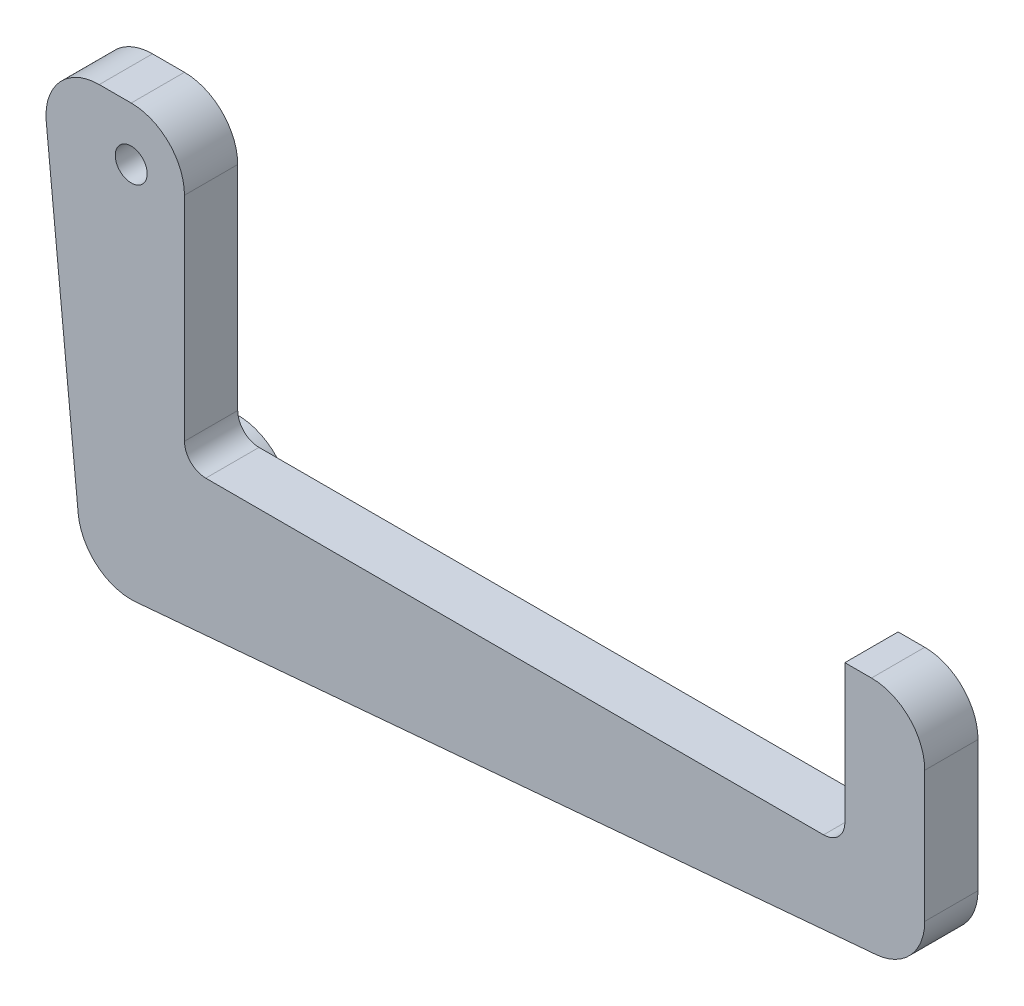
ISO-10303-21;
HEADER;
FILE_DESCRIPTION(('STEP AP214'),'2;1');
FILE_NAME('part.step','',(''),(''),'','','');
FILE_SCHEMA(('AUTOMOTIVE_DESIGN { 1 0 10303 214 1 1 1 1 }'));
ENDSEC;
DATA;
#1=APPLICATION_CONTEXT('core data for automotive mechanical design processes');
#2=APPLICATION_PROTOCOL_DEFINITION('international standard','automotive_design',2000,#1);
#3=PRODUCT_CONTEXT('',#1,'mechanical');
#4=PRODUCT('Part','Part','',(#3));
#5=PRODUCT_RELATED_PRODUCT_CATEGORY('part','',(#4));
#6=PRODUCT_DEFINITION_FORMATION('','',#4);
#7=PRODUCT_DEFINITION_CONTEXT('part definition',#1,'design');
#8=PRODUCT_DEFINITION('design','',#6,#7);
#9=PRODUCT_DEFINITION_SHAPE('','',#8);
#10=(LENGTH_UNIT() NAMED_UNIT(*) SI_UNIT(.MILLI.,.METRE.));
#11=(NAMED_UNIT(*) PLANE_ANGLE_UNIT() SI_UNIT($,.RADIAN.));
#12=(NAMED_UNIT(*) SI_UNIT($,.STERADIAN.) SOLID_ANGLE_UNIT());
#13=UNCERTAINTY_MEASURE_WITH_UNIT(LENGTH_MEASURE(1.E-05),#10,'distance_accuracy_value','');
#14=(GEOMETRIC_REPRESENTATION_CONTEXT(3) GLOBAL_UNCERTAINTY_ASSIGNED_CONTEXT((#13)) GLOBAL_UNIT_ASSIGNED_CONTEXT((#10,
#11,#12)) REPRESENTATION_CONTEXT('',''));
#15=CARTESIAN_POINT('',(0.,0.,0.));
#16=DIRECTION('',(0.,0.,1.));
#17=DIRECTION('',(1.,0.,0.));
#18=AXIS2_PLACEMENT_3D('',#15,#16,#17);
#19=CARTESIAN_POINT('',(19.05,-10.16,6.35));
#20=DIRECTION('',(0.,0.,-1.));
#21=DIRECTION('',(-1.,0.,0.));
#22=AXIS2_PLACEMENT_3D('',#19,#20,#21);
#23=CYLINDRICAL_SURFACE('',#22,6.35);
#24=DIRECTION('',(0.,0.,1.));
#25=VECTOR('',#24,1.);
#26=CARTESIAN_POINT('',(19.05,-3.80999999999999,0.));
#27=LINE('',#26,#25);
#28=CARTESIAN_POINT('',(19.05,-3.80999999999999,0.));
#29=VERTEX_POINT('',#28);
#30=CARTESIAN_POINT('',(19.05,-3.80999999999999,6.35));
#31=VERTEX_POINT('',#30);
#32=EDGE_CURVE('E263',#29,#31,#27,.T.);
#33=ORIENTED_EDGE('',*,*,#32,.T.);
#34=CARTESIAN_POINT('',(19.05,-10.16,6.35));
#35=DIRECTION('',(0.,0.,1.));
#36=DIRECTION('',(1.,0.,0.));
#37=AXIS2_PLACEMENT_3D('',#34,#35,#36);
#38=CIRCLE('',#37,6.35);
#39=CARTESIAN_POINT('',(25.4,-10.16,6.35));
#40=VERTEX_POINT('',#39);
#41=EDGE_CURVE('E225',#40,#31,#38,.T.);
#42=ORIENTED_EDGE('',*,*,#41,.F.);
#43=DIRECTION('',(0.,0.,-1.));
#44=VECTOR('',#43,1.);
#45=CARTESIAN_POINT('',(25.4,-10.16,6.35));
#46=LINE('',#45,#44);
#47=CARTESIAN_POINT('',(25.4,-10.16,0.));
#48=VERTEX_POINT('',#47);
#49=EDGE_CURVE('E193',#40,#48,#46,.T.);
#50=ORIENTED_EDGE('',*,*,#49,.T.);
#51=CARTESIAN_POINT('',(19.05,-10.16,0.));
#52=DIRECTION('',(0.,0.,1.));
#53=DIRECTION('',(-1.,0.,0.));
#54=AXIS2_PLACEMENT_3D('',#51,#52,#53);
#55=CIRCLE('',#54,6.35);
#56=EDGE_CURVE('E172',#48,#29,#55,.T.);
#57=ORIENTED_EDGE('',*,*,#56,.T.);
#58=EDGE_LOOP('',(#33,#42,#50,#57));
#59=FACE_BOUND('',#58,.T.);
#60=ADVANCED_FACE('F32',(#59),#23,.T.);
#61=CARTESIAN_POINT('',(101.6,-35.56,6.35));
#62=DIRECTION('',(0.,0.,-1.));
#63=DIRECTION('',(-1.,0.,0.));
#64=AXIS2_PLACEMENT_3D('',#61,#62,#63);
#65=PLANE('',#64);
#66=ORIENTED_EDGE('',*,*,#41,.T.);
#67=DIRECTION('',(-1.,0.,0.));
#68=VECTOR('',#67,1.);
#69=CARTESIAN_POINT('',(15.24,-3.80999999999999,6.35));
#70=LINE('',#69,#68);
#71=CARTESIAN_POINT('',(15.24,-3.80999999999999,6.35));
#72=VERTEX_POINT('',#71);
#73=EDGE_CURVE('E278',#31,#72,#70,.T.);
#74=ORIENTED_EDGE('',*,*,#73,.T.);
#75=CARTESIAN_POINT('',(15.24,-10.16,6.35));
#76=DIRECTION('',(0.,0.,1.));
#77=DIRECTION('',(-1.,0.,0.));
#78=AXIS2_PLACEMENT_3D('',#75,#76,#77);
#79=CIRCLE('',#78,6.35);
#80=CARTESIAN_POINT('',(8.92075359058098,-10.7841993407915,6.35));
#81=VERTEX_POINT('',#80);
#82=EDGE_CURVE('E276',#72,#81,#79,.T.);
#83=ORIENTED_EDGE('',*,*,#82,.T.);
#84=DIRECTION('',(0.0982991087860656,-0.99515691486914,0.));
#85=VECTOR('',#84,1.);
#86=CARTESIAN_POINT('',(12.730753590581,-49.3557377044119,6.35));
#87=LINE('',#86,#85);
#88=CARTESIAN_POINT('',(12.730753590581,-49.3557377044119,6.35));
#89=VERTEX_POINT('',#88);
#90=EDGE_CURVE('E47',#81,#89,#87,.T.);
#91=ORIENTED_EDGE('',*,*,#90,.T.);
#92=CARTESIAN_POINT('',(19.05,-48.7315383636204,6.35));
#93=DIRECTION('',(0.,0.,1.));
#94=DIRECTION('',(1.,0.,0.));
#95=AXIS2_PLACEMENT_3D('',#92,#93,#94);
#96=CIRCLE('',#95,6.34999999999999);
#97=CARTESIAN_POINT('',(19.6034389664476,-55.057374696503,6.35));
#98=VERTEX_POINT('',#97);
#99=EDGE_CURVE('E228',#89,#98,#96,.T.);
#100=ORIENTED_EDGE('',*,*,#99,.T.);
#101=DIRECTION('',(0.996194698091746,0.0871557427476517,0.));
#102=VECTOR('',#101,1.);
#103=CARTESIAN_POINT('',(19.6034389664476,-55.057374696503,6.35));
#104=LINE('',#103,#102);
#105=CARTESIAN_POINT('',(107.868438966448,-47.3351878103879,6.35));
#106=VERTEX_POINT('',#105);
#107=EDGE_CURVE('E234',#98,#106,#104,.T.);
#108=ORIENTED_EDGE('',*,*,#107,.T.);
#109=CARTESIAN_POINT('',(107.315,-41.0093514775053,6.35));
#110=DIRECTION('',(0.,0.,1.));
#111=DIRECTION('',(1.,0.,0.));
#112=AXIS2_PLACEMENT_3D('',#109,#110,#111);
#113=CIRCLE('',#112,6.35);
#114=CARTESIAN_POINT('',(113.665,-41.0093514775053,6.35));
#115=VERTEX_POINT('',#114);
#116=EDGE_CURVE('E138',#106,#115,#113,.T.);
#117=ORIENTED_EDGE('',*,*,#116,.T.);
#118=DIRECTION('',(0.,1.,0.));
#119=VECTOR('',#118,1.);
#120=CARTESIAN_POINT('',(113.665,-41.0093514775053,6.35));
#121=LINE('',#120,#119);
#122=CARTESIAN_POINT('',(113.665,-25.4,6.35));
#123=VERTEX_POINT('',#122);
#124=EDGE_CURVE('E129',#115,#123,#121,.T.);
#125=ORIENTED_EDGE('',*,*,#124,.T.);
#126=CARTESIAN_POINT('',(107.315,-25.4,6.35));
#127=DIRECTION('',(0.,0.,1.));
#128=DIRECTION('',(1.,0.,0.));
#129=AXIS2_PLACEMENT_3D('',#126,#127,#128);
#130=CIRCLE('',#129,6.35);
#131=CARTESIAN_POINT('',(107.315,-19.05,6.35));
#132=VERTEX_POINT('',#131);
#133=EDGE_CURVE('E135',#123,#132,#130,.T.);
#134=ORIENTED_EDGE('',*,*,#133,.T.);
#135=DIRECTION('',(-1.,0.,0.));
#136=VECTOR('',#135,1.);
#137=CARTESIAN_POINT('',(107.315,-19.05,6.35));
#138=LINE('',#137,#136);
#139=CARTESIAN_POINT('',(104.14,-19.05,6.35));
#140=VERTEX_POINT('',#139);
#141=EDGE_CURVE('E55',#132,#140,#138,.T.);
#142=ORIENTED_EDGE('',*,*,#141,.T.);
#143=DIRECTION('',(0.,-1.,0.));
#144=VECTOR('',#143,1.);
#145=CARTESIAN_POINT('',(104.14,-19.05,6.35));
#146=LINE('',#145,#144);
#147=CARTESIAN_POINT('',(104.14,-35.56,6.35));
#148=VERTEX_POINT('',#147);
#149=EDGE_CURVE('E183',#140,#148,#146,.T.);
#150=ORIENTED_EDGE('',*,*,#149,.T.);
#151=CARTESIAN_POINT('',(101.6,-35.56,6.35));
#152=DIRECTION('',(0.,0.,-1.));
#153=DIRECTION('',(-1.,0.,0.));
#154=AXIS2_PLACEMENT_3D('',#151,#152,#153);
#155=CIRCLE('',#154,2.53999999999999);
#156=CARTESIAN_POINT('',(101.6,-38.1,6.35));
#157=VERTEX_POINT('',#156);
#158=EDGE_CURVE('E105',#148,#157,#155,.T.);
#159=ORIENTED_EDGE('',*,*,#158,.T.);
#160=DIRECTION('',(-1.,0.,0.));
#161=VECTOR('',#160,1.);
#162=CARTESIAN_POINT('',(101.6,-38.1,6.35));
#163=LINE('',#162,#161);
#164=CARTESIAN_POINT('',(27.94,-38.1,6.35));
#165=VERTEX_POINT('',#164);
#166=EDGE_CURVE('E207',#157,#165,#163,.T.);
#167=ORIENTED_EDGE('',*,*,#166,.T.);
#168=CARTESIAN_POINT('',(27.94,-35.56,6.35));
#169=DIRECTION('',(0.,0.,-1.));
#170=DIRECTION('',(-1.,0.,0.));
#171=AXIS2_PLACEMENT_3D('',#168,#169,#170);
#172=CIRCLE('',#171,2.54);
#173=CARTESIAN_POINT('',(25.4,-35.56,6.35));
#174=VERTEX_POINT('',#173);
#175=EDGE_CURVE('E226',#165,#174,#172,.T.);
#176=ORIENTED_EDGE('',*,*,#175,.T.);
#177=DIRECTION('',(0.,1.,0.));
#178=VECTOR('',#177,1.);
#179=CARTESIAN_POINT('',(25.4,-35.56,6.35));
#180=LINE('',#179,#178);
#181=EDGE_CURVE('E223',#174,#40,#180,.T.);
#182=ORIENTED_EDGE('',*,*,#181,.T.);
#183=EDGE_LOOP('',(#66,#74,#83,#91,#100,#108,#117,#125,#134,#142,#150,#159,#167,#176,#182));
#184=FACE_BOUND('',#183,.T.);
#185=CARTESIAN_POINT('',(19.05,-10.16,6.35));
#186=DIRECTION('',(0.,0.,1.));
#187=DIRECTION('',(1.,0.,0.));
#188=AXIS2_PLACEMENT_3D('',#185,#186,#187);
#189=CIRCLE('',#188,1.905);
#190=CARTESIAN_POINT('',(20.955,-10.16,6.35));
#191=VERTEX_POINT('',#190);
#192=EDGE_CURVE('E163',#191,#191,#189,.T.);
#193=ORIENTED_EDGE('',*,*,#192,.F.);
#194=EDGE_LOOP('',(#193));
#195=FACE_BOUND('',#194,.T.);
#196=ADVANCED_FACE('F132',(#184,#195),#65,.F.);
#197=CARTESIAN_POINT('',(101.6,-35.56,0.));
#198=DIRECTION('',(0.,0.,-1.));
#199=DIRECTION('',(-1.,0.,0.));
#200=AXIS2_PLACEMENT_3D('',#197,#198,#199);
#201=PLANE('',#200);
#202=DIRECTION('',(-1.,0.,0.));
#203=VECTOR('',#202,1.);
#204=CARTESIAN_POINT('',(15.24,-3.80999999999999,0.));
#205=LINE('',#204,#203);
#206=CARTESIAN_POINT('',(15.24,-3.80999999999999,0.));
#207=VERTEX_POINT('',#206);
#208=EDGE_CURVE('E275',#29,#207,#205,.T.);
#209=ORIENTED_EDGE('',*,*,#208,.F.);
#210=ORIENTED_EDGE('',*,*,#56,.F.);
#211=DIRECTION('',(0.,1.,0.));
#212=VECTOR('',#211,1.);
#213=CARTESIAN_POINT('',(25.4,-35.56,0.));
#214=LINE('',#213,#212);
#215=CARTESIAN_POINT('',(25.4,-35.56,0.));
#216=VERTEX_POINT('',#215);
#217=EDGE_CURVE('E169',#216,#48,#214,.T.);
#218=ORIENTED_EDGE('',*,*,#217,.F.);
#219=CARTESIAN_POINT('',(27.94,-35.56,0.));
#220=DIRECTION('',(0.,0.,-1.));
#221=DIRECTION('',(-1.,0.,0.));
#222=AXIS2_PLACEMENT_3D('',#219,#220,#221);
#223=CIRCLE('',#222,2.54);
#224=CARTESIAN_POINT('',(27.94,-38.1,0.));
#225=VERTEX_POINT('',#224);
#226=EDGE_CURVE('E167',#225,#216,#223,.T.);
#227=ORIENTED_EDGE('',*,*,#226,.F.);
#228=DIRECTION('',(-1.,0.,0.));
#229=VECTOR('',#228,1.);
#230=CARTESIAN_POINT('',(101.6,-38.1,0.));
#231=LINE('',#230,#229);
#232=CARTESIAN_POINT('',(101.6,-38.1,0.));
#233=VERTEX_POINT('',#232);
#234=EDGE_CURVE('E165',#233,#225,#231,.T.);
#235=ORIENTED_EDGE('',*,*,#234,.F.);
#236=CARTESIAN_POINT('',(101.6,-35.56,0.));
#237=DIRECTION('',(0.,0.,-1.));
#238=DIRECTION('',(-1.,0.,0.));
#239=AXIS2_PLACEMENT_3D('',#236,#237,#238);
#240=CIRCLE('',#239,2.53999999999999);
#241=CARTESIAN_POINT('',(104.14,-35.56,0.));
#242=VERTEX_POINT('',#241);
#243=EDGE_CURVE('E162',#242,#233,#240,.T.);
#244=ORIENTED_EDGE('',*,*,#243,.F.);
#245=DIRECTION('',(0.,-1.,0.));
#246=VECTOR('',#245,1.);
#247=CARTESIAN_POINT('',(104.14,-19.05,0.));
#248=LINE('',#247,#246);
#249=CARTESIAN_POINT('',(104.14,-19.05,0.));
#250=VERTEX_POINT('',#249);
#251=EDGE_CURVE('E159',#250,#242,#248,.T.);
#252=ORIENTED_EDGE('',*,*,#251,.F.);
#253=DIRECTION('',(-1.,0.,0.));
#254=VECTOR('',#253,1.);
#255=CARTESIAN_POINT('',(107.315,-19.05,0.));
#256=LINE('',#255,#254);
#257=CARTESIAN_POINT('',(107.315,-19.05,0.));
#258=VERTEX_POINT('',#257);
#259=EDGE_CURVE('E97',#258,#250,#256,.T.);
#260=ORIENTED_EDGE('',*,*,#259,.F.);
#261=CARTESIAN_POINT('',(107.315,-25.4,0.));
#262=DIRECTION('',(0.,0.,1.));
#263=DIRECTION('',(1.,0.,0.));
#264=AXIS2_PLACEMENT_3D('',#261,#262,#263);
#265=CIRCLE('',#264,6.35);
#266=CARTESIAN_POINT('',(113.665,-25.4,0.));
#267=VERTEX_POINT('',#266);
#268=EDGE_CURVE('E180',#267,#258,#265,.T.);
#269=ORIENTED_EDGE('',*,*,#268,.F.);
#270=DIRECTION('',(0.,1.,0.));
#271=VECTOR('',#270,1.);
#272=CARTESIAN_POINT('',(113.665,-41.0093514775053,0.));
#273=LINE('',#272,#271);
#274=CARTESIAN_POINT('',(113.665,-41.0093514775053,0.));
#275=VERTEX_POINT('',#274);
#276=EDGE_CURVE('E147',#275,#267,#273,.T.);
#277=ORIENTED_EDGE('',*,*,#276,.F.);
#278=CARTESIAN_POINT('',(107.315,-41.0093514775053,0.));
#279=DIRECTION('',(0.,0.,1.));
#280=DIRECTION('',(1.,0.,0.));
#281=AXIS2_PLACEMENT_3D('',#278,#279,#280);
#282=CIRCLE('',#281,6.35);
#283=CARTESIAN_POINT('',(107.868438966448,-47.3351878103879,0.));
#284=VERTEX_POINT('',#283);
#285=EDGE_CURVE('E177',#284,#275,#282,.T.);
#286=ORIENTED_EDGE('',*,*,#285,.F.);
#287=DIRECTION('',(0.996194698091746,0.0871557427476517,0.));
#288=VECTOR('',#287,1.);
#289=CARTESIAN_POINT('',(19.6034389664476,-55.057374696503,0.));
#290=LINE('',#289,#288);
#291=CARTESIAN_POINT('',(19.6034389664476,-55.057374696503,0.));
#292=VERTEX_POINT('',#291);
#293=EDGE_CURVE('E175',#292,#284,#290,.T.);
#294=ORIENTED_EDGE('',*,*,#293,.F.);
#295=CARTESIAN_POINT('',(19.05,-48.7315383636204,0.));
#296=DIRECTION('',(0.,0.,-1.));
#297=DIRECTION('',(-1.,0.,0.));
#298=AXIS2_PLACEMENT_3D('',#295,#296,#297);
#299=CIRCLE('',#298,6.34999999999999);
#300=CARTESIAN_POINT('',(12.730753590581,-49.3557377044119,0.));
#301=VERTEX_POINT('',#300);
#302=EDGE_CURVE('E255',#301,#292,#299,.T.);
#303=ORIENTED_EDGE('',*,*,#302,.F.);
#304=DIRECTION('',(0.0982991087860656,-0.99515691486914,0.));
#305=VECTOR('',#304,1.);
#306=CARTESIAN_POINT('',(12.730753590581,-49.3557377044119,0.));
#307=LINE('',#306,#305);
#308=CARTESIAN_POINT('',(8.92075359058098,-10.7841993407915,0.));
#309=VERTEX_POINT('',#308);
#310=EDGE_CURVE('E267',#309,#301,#307,.T.);
#311=ORIENTED_EDGE('',*,*,#310,.F.);
#312=CARTESIAN_POINT('',(15.24,-10.16,0.));
#313=DIRECTION('',(0.,0.,1.));
#314=DIRECTION('',(-1.,0.,0.));
#315=AXIS2_PLACEMENT_3D('',#312,#313,#314);
#316=CIRCLE('',#315,6.35);
#317=EDGE_CURVE('E283',#207,#309,#316,.T.);
#318=ORIENTED_EDGE('',*,*,#317,.F.);
#319=EDGE_LOOP('',(#209,#210,#218,#227,#235,#244,#252,#260,#269,#277,#286,#294,#303,#311,#318));
#320=FACE_BOUND('',#319,.T.);
#321=CARTESIAN_POINT('',(19.05,-10.16,0.));
#322=DIRECTION('',(0.,0.,1.));
#323=DIRECTION('',(1.,0.,0.));
#324=AXIS2_PLACEMENT_3D('',#321,#322,#323);
#325=CIRCLE('',#324,1.905);
#326=CARTESIAN_POINT('',(20.955,-10.16,0.));
#327=VERTEX_POINT('',#326);
#328=EDGE_CURVE('E252',#327,#327,#325,.T.);
#329=ORIENTED_EDGE('',*,*,#328,.T.);
#330=EDGE_LOOP('',(#329));
#331=FACE_BOUND('',#330,.T.);
#332=ADVANCED_FACE('F211',(#320,#331),#201,.T.);
#333=CARTESIAN_POINT('',(104.14,-19.05,6.35));
#334=DIRECTION('',(1.,0.,0.));
#335=DIRECTION('',(0.,0.,-1.));
#336=AXIS2_PLACEMENT_3D('',#333,#334,#335);
#337=PLANE('',#336);
#338=ORIENTED_EDGE('',*,*,#251,.T.);
#339=DIRECTION('',(0.,0.,-1.));
#340=VECTOR('',#339,1.);
#341=CARTESIAN_POINT('',(104.14,-35.56,6.35));
#342=LINE('',#341,#340);
#343=EDGE_CURVE('E11',#148,#242,#342,.T.);
#344=ORIENTED_EDGE('',*,*,#343,.F.);
#345=ORIENTED_EDGE('',*,*,#149,.F.);
#346=DIRECTION('',(0.,0.,-1.));
#347=VECTOR('',#346,1.);
#348=CARTESIAN_POINT('',(104.14,-19.05,6.35));
#349=LINE('',#348,#347);
#350=EDGE_CURVE('E155',#140,#250,#349,.T.);
#351=ORIENTED_EDGE('',*,*,#350,.T.);
#352=EDGE_LOOP('',(#338,#344,#345,#351));
#353=FACE_BOUND('',#352,.T.);
#354=ADVANCED_FACE('F34',(#353),#337,.F.);
#355=CARTESIAN_POINT('',(101.6,-35.56,6.35));
#356=DIRECTION('',(0.,0.,-1.));
#357=DIRECTION('',(-1.,0.,0.));
#358=AXIS2_PLACEMENT_3D('',#355,#356,#357);
#359=CYLINDRICAL_SURFACE('',#358,2.53999999999999);
#360=ORIENTED_EDGE('',*,*,#243,.T.);
#361=DIRECTION('',(0.,0.,-1.));
#362=VECTOR('',#361,1.);
#363=CARTESIAN_POINT('',(101.6,-38.1,6.35));
#364=LINE('',#363,#362);
#365=EDGE_CURVE('E40',#157,#233,#364,.T.);
#366=ORIENTED_EDGE('',*,*,#365,.F.);
#367=ORIENTED_EDGE('',*,*,#158,.F.);
#368=ORIENTED_EDGE('',*,*,#343,.T.);
#369=EDGE_LOOP('',(#360,#366,#367,#368));
#370=FACE_BOUND('',#369,.T.);
#371=ADVANCED_FACE('F345',(#370),#359,.F.);
#372=CARTESIAN_POINT('',(101.6,-38.1,6.35));
#373=DIRECTION('',(0.,-1.,0.));
#374=DIRECTION('',(1.,0.,0.));
#375=AXIS2_PLACEMENT_3D('',#372,#373,#374);
#376=PLANE('',#375);
#377=ORIENTED_EDGE('',*,*,#234,.T.);
#378=DIRECTION('',(0.,0.,-1.));
#379=VECTOR('',#378,1.);
#380=CARTESIAN_POINT('',(27.94,-38.1,6.35));
#381=LINE('',#380,#379);
#382=EDGE_CURVE('E199',#165,#225,#381,.T.);
#383=ORIENTED_EDGE('',*,*,#382,.F.);
#384=ORIENTED_EDGE('',*,*,#166,.F.);
#385=ORIENTED_EDGE('',*,*,#365,.T.);
#386=EDGE_LOOP('',(#377,#383,#384,#385));
#387=FACE_BOUND('',#386,.T.);
#388=ADVANCED_FACE('F205',(#387),#376,.F.);
#389=CARTESIAN_POINT('',(27.94,-35.56,6.35));
#390=DIRECTION('',(0.,0.,-1.));
#391=DIRECTION('',(-1.,0.,0.));
#392=AXIS2_PLACEMENT_3D('',#389,#390,#391);
#393=CYLINDRICAL_SURFACE('',#392,2.54);
#394=ORIENTED_EDGE('',*,*,#226,.T.);
#395=DIRECTION('',(0.,0.,-1.));
#396=VECTOR('',#395,1.);
#397=CARTESIAN_POINT('',(25.4,-35.56,6.35));
#398=LINE('',#397,#396);
#399=EDGE_CURVE('E196',#174,#216,#398,.T.);
#400=ORIENTED_EDGE('',*,*,#399,.F.);
#401=ORIENTED_EDGE('',*,*,#175,.F.);
#402=ORIENTED_EDGE('',*,*,#382,.T.);
#403=EDGE_LOOP('',(#394,#400,#401,#402));
#404=FACE_BOUND('',#403,.T.);
#405=ADVANCED_FACE('F217',(#404),#393,.F.);
#406=CARTESIAN_POINT('',(25.4,-35.56,6.35));
#407=DIRECTION('',(-1.,0.,0.));
#408=DIRECTION('',(0.,-1.,0.));
#409=AXIS2_PLACEMENT_3D('',#406,#407,#408);
#410=PLANE('',#409);
#411=ORIENTED_EDGE('',*,*,#217,.T.);
#412=ORIENTED_EDGE('',*,*,#49,.F.);
#413=ORIENTED_EDGE('',*,*,#181,.F.);
#414=ORIENTED_EDGE('',*,*,#399,.T.);
#415=EDGE_LOOP('',(#411,#412,#413,#414));
#416=FACE_BOUND('',#415,.T.);
#417=ADVANCED_FACE('F221',(#416),#410,.F.);
#418=CARTESIAN_POINT('',(19.05,-48.7315383636204,6.35));
#419=DIRECTION('',(0.,0.,-1.));
#420=DIRECTION('',(-1.,0.,0.));
#421=AXIS2_PLACEMENT_3D('',#418,#419,#420);
#422=CYLINDRICAL_SURFACE('',#421,6.34999999999999);
#423=ORIENTED_EDGE('',*,*,#99,.F.);
#424=DIRECTION('',(0.,0.,1.));
#425=VECTOR('',#424,1.);
#426=CARTESIAN_POINT('',(12.730753590581,-49.3557377044119,0.));
#427=LINE('',#426,#425);
#428=EDGE_CURVE('E262',#301,#89,#427,.T.);
#429=ORIENTED_EDGE('',*,*,#428,.F.);
#430=ORIENTED_EDGE('',*,*,#302,.T.);
#431=DIRECTION('',(0.,0.,-1.));
#432=VECTOR('',#431,1.);
#433=CARTESIAN_POINT('',(19.6034389664476,-55.057374696503,6.35));
#434=LINE('',#433,#432);
#435=EDGE_CURVE('E190',#98,#292,#434,.T.);
#436=ORIENTED_EDGE('',*,*,#435,.F.);
#437=EDGE_LOOP('',(#423,#429,#430,#436));
#438=FACE_BOUND('',#437,.T.);
#439=CARTESIAN_POINT('',(19.05,-48.7315383636204,-6.35));
#440=DIRECTION('',(0.,0.,1.));
#441=DIRECTION('',(1.,0.,0.));
#442=AXIS2_PLACEMENT_3D('',#439,#440,#441);
#443=CIRCLE('',#442,6.34999999999999);
#444=CARTESIAN_POINT('',(25.4,-48.7315383636204,-6.35));
#445=VERTEX_POINT('',#444);
#446=EDGE_CURVE('E259',#445,#445,#443,.T.);
#447=ORIENTED_EDGE('',*,*,#446,.T.);
#448=EDGE_LOOP('',(#447));
#449=FACE_BOUND('',#448,.T.);
#450=ADVANCED_FACE('F314',(#438,#449),#422,.T.);
#451=CARTESIAN_POINT('',(19.6034389664476,-55.057374696503,6.35));
#452=DIRECTION('',(-0.0871557427476517,0.996194698091746,0.));
#453=DIRECTION('',(-0.996194698091746,-0.0871557427476517,0.));
#454=AXIS2_PLACEMENT_3D('',#451,#452,#453);
#455=PLANE('',#454);
#456=ORIENTED_EDGE('',*,*,#293,.T.);
#457=DIRECTION('',(0.,0.,-1.));
#458=VECTOR('',#457,1.);
#459=CARTESIAN_POINT('',(107.868438966448,-47.3351878103879,6.35));
#460=LINE('',#459,#458);
#461=EDGE_CURVE('E187',#106,#284,#460,.T.);
#462=ORIENTED_EDGE('',*,*,#461,.F.);
#463=ORIENTED_EDGE('',*,*,#107,.F.);
#464=ORIENTED_EDGE('',*,*,#435,.T.);
#465=EDGE_LOOP('',(#456,#462,#463,#464));
#466=FACE_BOUND('',#465,.T.);
#467=ADVANCED_FACE('F240',(#466),#455,.F.);
#468=CARTESIAN_POINT('',(107.315,-41.0093514775053,6.35));
#469=DIRECTION('',(0.,0.,-1.));
#470=DIRECTION('',(-1.,0.,0.));
#471=AXIS2_PLACEMENT_3D('',#468,#469,#470);
#472=CYLINDRICAL_SURFACE('',#471,6.35);
#473=ORIENTED_EDGE('',*,*,#285,.T.);
#474=DIRECTION('',(0.,0.,-1.));
#475=VECTOR('',#474,1.);
#476=CARTESIAN_POINT('',(113.665,-41.0093514775053,6.35));
#477=LINE('',#476,#475);
#478=EDGE_CURVE('E150',#115,#275,#477,.T.);
#479=ORIENTED_EDGE('',*,*,#478,.F.);
#480=ORIENTED_EDGE('',*,*,#116,.F.);
#481=ORIENTED_EDGE('',*,*,#461,.T.);
#482=EDGE_LOOP('',(#473,#479,#480,#481));
#483=FACE_BOUND('',#482,.T.);
#484=ADVANCED_FACE('F244',(#483),#472,.T.);
#485=CARTESIAN_POINT('',(113.665,-41.0093514775053,6.35));
#486=DIRECTION('',(-1.,0.,0.));
#487=DIRECTION('',(0.,-1.,0.));
#488=AXIS2_PLACEMENT_3D('',#485,#486,#487);
#489=PLANE('',#488);
#490=ORIENTED_EDGE('',*,*,#276,.T.);
#491=DIRECTION('',(0.,0.,-1.));
#492=VECTOR('',#491,1.);
#493=CARTESIAN_POINT('',(113.665,-25.4,6.35));
#494=LINE('',#493,#492);
#495=EDGE_CURVE('E144',#123,#267,#494,.T.);
#496=ORIENTED_EDGE('',*,*,#495,.F.);
#497=ORIENTED_EDGE('',*,*,#124,.F.);
#498=ORIENTED_EDGE('',*,*,#478,.T.);
#499=EDGE_LOOP('',(#490,#496,#497,#498));
#500=FACE_BOUND('',#499,.T.);
#501=ADVANCED_FACE('F145',(#500),#489,.F.);
#502=CARTESIAN_POINT('',(107.315,-25.4,6.35));
#503=DIRECTION('',(0.,0.,-1.));
#504=DIRECTION('',(-1.,0.,0.));
#505=AXIS2_PLACEMENT_3D('',#502,#503,#504);
#506=CYLINDRICAL_SURFACE('',#505,6.35);
#507=ORIENTED_EDGE('',*,*,#268,.T.);
#508=DIRECTION('',(0.,0.,-1.));
#509=VECTOR('',#508,1.);
#510=CARTESIAN_POINT('',(107.315,-19.05,6.35));
#511=LINE('',#510,#509);
#512=EDGE_CURVE('E151',#132,#258,#511,.T.);
#513=ORIENTED_EDGE('',*,*,#512,.F.);
#514=ORIENTED_EDGE('',*,*,#133,.F.);
#515=ORIENTED_EDGE('',*,*,#495,.T.);
#516=EDGE_LOOP('',(#507,#513,#514,#515));
#517=FACE_BOUND('',#516,.T.);
#518=ADVANCED_FACE('F153',(#517),#506,.T.);
#519=CARTESIAN_POINT('',(107.315,-19.05,6.35));
#520=DIRECTION('',(0.,-1.,0.));
#521=DIRECTION('',(0.,0.,-1.));
#522=AXIS2_PLACEMENT_3D('',#519,#520,#521);
#523=PLANE('',#522);
#524=ORIENTED_EDGE('',*,*,#259,.T.);
#525=ORIENTED_EDGE('',*,*,#350,.F.);
#526=ORIENTED_EDGE('',*,*,#141,.F.);
#527=ORIENTED_EDGE('',*,*,#512,.T.);
#528=EDGE_LOOP('',(#524,#525,#526,#527));
#529=FACE_BOUND('',#528,.T.);
#530=ADVANCED_FACE('F245',(#529),#523,.F.);
#531=CARTESIAN_POINT('',(19.05,-10.16,6.35));
#532=DIRECTION('',(0.,0.,-1.));
#533=DIRECTION('',(-1.,0.,0.));
#534=AXIS2_PLACEMENT_3D('',#531,#532,#533);
#535=CYLINDRICAL_SURFACE('',#534,1.905);
#536=ORIENTED_EDGE('',*,*,#192,.T.);
#537=EDGE_LOOP('',(#536));
#538=FACE_BOUND('',#537,.T.);
#539=ORIENTED_EDGE('',*,*,#328,.F.);
#540=EDGE_LOOP('',(#539));
#541=FACE_BOUND('',#540,.T.);
#542=ADVANCED_FACE('F322',(#538,#541),#535,.F.);
#543=CARTESIAN_POINT('',(19.05,-48.7315383636204,-6.35));
#544=DIRECTION('',(0.,0.,1.));
#545=DIRECTION('',(1.,0.,0.));
#546=AXIS2_PLACEMENT_3D('',#543,#544,#545);
#547=PLANE('',#546);
#548=ORIENTED_EDGE('',*,*,#446,.F.);
#549=EDGE_LOOP('',(#548));
#550=FACE_BOUND('',#549,.T.);
#551=ADVANCED_FACE('F320',(#550),#547,.F.);
#552=CARTESIAN_POINT('',(12.730753590581,-49.3557377044119,0.));
#553=DIRECTION('',(-0.99515691486914,-0.0982991087860656,0.));
#554=DIRECTION('',(0.0982991087860656,-0.99515691486914,0.));
#555=AXIS2_PLACEMENT_3D('',#552,#553,#554);
#556=PLANE('',#555);
#557=ORIENTED_EDGE('',*,*,#90,.F.);
#558=DIRECTION('',(0.,0.,1.));
#559=VECTOR('',#558,1.);
#560=CARTESIAN_POINT('',(8.92075359058098,-10.7841993407915,0.));
#561=LINE('',#560,#559);
#562=EDGE_CURVE('E270',#309,#81,#561,.T.);
#563=ORIENTED_EDGE('',*,*,#562,.F.);
#564=ORIENTED_EDGE('',*,*,#310,.T.);
#565=ORIENTED_EDGE('',*,*,#428,.T.);
#566=EDGE_LOOP('',(#557,#563,#564,#565));
#567=FACE_BOUND('',#566,.T.);
#568=ADVANCED_FACE('F309',(#567),#556,.T.);
#569=CARTESIAN_POINT('',(15.24,-10.16,0.));
#570=DIRECTION('',(0.,0.,1.));
#571=DIRECTION('',(1.,0.,0.));
#572=AXIS2_PLACEMENT_3D('',#569,#570,#571);
#573=CYLINDRICAL_SURFACE('',#572,6.35);
#574=ORIENTED_EDGE('',*,*,#82,.F.);
#575=DIRECTION('',(0.,0.,1.));
#576=VECTOR('',#575,1.);
#577=CARTESIAN_POINT('',(15.24,-3.80999999999999,0.));
#578=LINE('',#577,#576);
#579=EDGE_CURVE('E266',#207,#72,#578,.T.);
#580=ORIENTED_EDGE('',*,*,#579,.F.);
#581=ORIENTED_EDGE('',*,*,#317,.T.);
#582=ORIENTED_EDGE('',*,*,#562,.T.);
#583=EDGE_LOOP('',(#574,#580,#581,#582));
#584=FACE_BOUND('',#583,.T.);
#585=ADVANCED_FACE('F312',(#584),#573,.T.);
#586=CARTESIAN_POINT('',(15.24,-3.80999999999999,0.));
#587=DIRECTION('',(0.,1.,0.));
#588=DIRECTION('',(-1.,0.,0.));
#589=AXIS2_PLACEMENT_3D('',#586,#587,#588);
#590=PLANE('',#589);
#591=ORIENTED_EDGE('',*,*,#73,.F.);
#592=ORIENTED_EDGE('',*,*,#32,.F.);
#593=ORIENTED_EDGE('',*,*,#208,.T.);
#594=ORIENTED_EDGE('',*,*,#579,.T.);
#595=EDGE_LOOP('',(#591,#592,#593,#594));
#596=FACE_BOUND('',#595,.T.);
#597=ADVANCED_FACE('F291',(#596),#590,.T.);
#598=CLOSED_SHELL('',(#60,#196,#332,#354,#371,#388,#405,#417,#450,#467,#484,#501,#518,#530,#542,
#551,#568,#585,#597));
#599=MANIFOLD_SOLID_BREP('B2',#598);
#600=ADVANCED_BREP_SHAPE_REPRESENTATION('',(#18,#599),#14);
#601=SHAPE_DEFINITION_REPRESENTATION(#9,#600);
ENDSEC;
END-ISO-10303-21;
